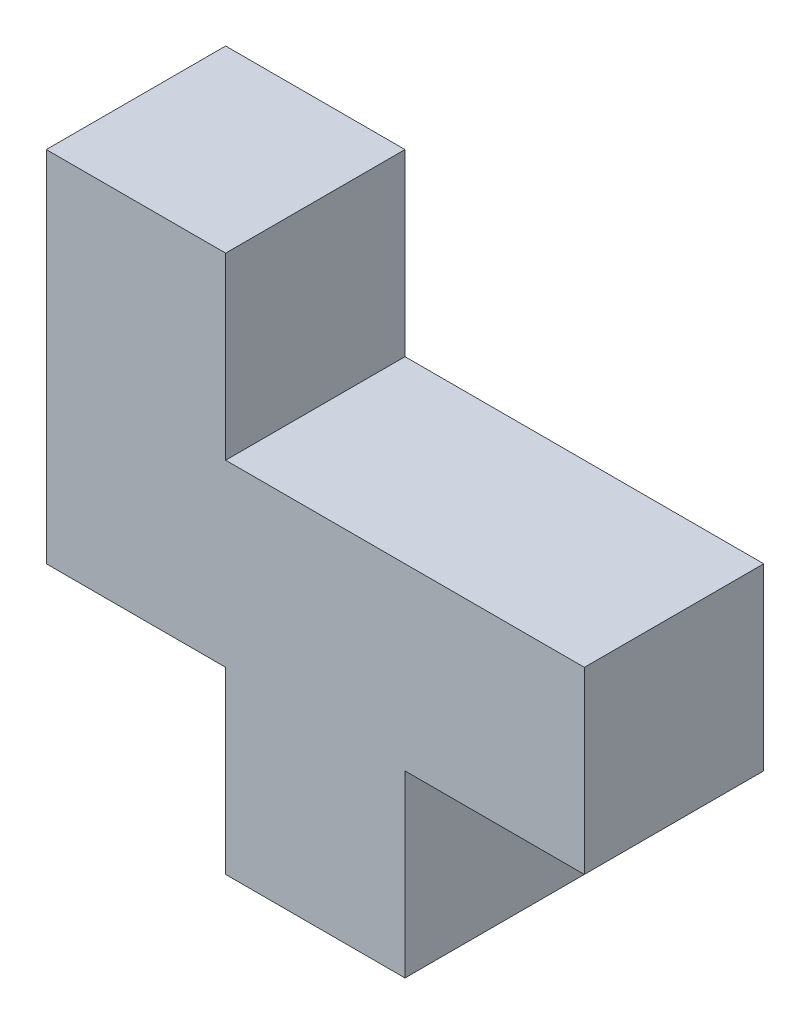
ISO-10303-21;
HEADER;
FILE_DESCRIPTION(('STEP AP214'),'2;1');
FILE_NAME('part.step','',(''),(''),'','','');
FILE_SCHEMA(('AUTOMOTIVE_DESIGN { 1 0 10303 214 1 1 1 1 }'));
ENDSEC;
DATA;
#1=APPLICATION_CONTEXT('core data for automotive mechanical design processes');
#2=APPLICATION_PROTOCOL_DEFINITION('international standard','automotive_design',2000,#1);
#3=PRODUCT_CONTEXT('',#1,'mechanical');
#4=PRODUCT('Part','Part','',(#3));
#5=PRODUCT_RELATED_PRODUCT_CATEGORY('part','',(#4));
#6=PRODUCT_DEFINITION_FORMATION('','',#4);
#7=PRODUCT_DEFINITION_CONTEXT('part definition',#1,'design');
#8=PRODUCT_DEFINITION('design','',#6,#7);
#9=PRODUCT_DEFINITION_SHAPE('','',#8);
#10=(LENGTH_UNIT() NAMED_UNIT(*) SI_UNIT(.MILLI.,.METRE.));
#11=(NAMED_UNIT(*) PLANE_ANGLE_UNIT() SI_UNIT($,.RADIAN.));
#12=(NAMED_UNIT(*) SI_UNIT($,.STERADIAN.) SOLID_ANGLE_UNIT());
#13=UNCERTAINTY_MEASURE_WITH_UNIT(LENGTH_MEASURE(1.E-05),#10,'distance_accuracy_value','');
#14=(GEOMETRIC_REPRESENTATION_CONTEXT(3) GLOBAL_UNCERTAINTY_ASSIGNED_CONTEXT((#13)) GLOBAL_UNIT_ASSIGNED_CONTEXT((#10,
#11,#12)) REPRESENTATION_CONTEXT('',''));
#15=CARTESIAN_POINT('',(0.,0.,0.));
#16=DIRECTION('',(0.,0.,1.));
#17=DIRECTION('',(1.,0.,0.));
#18=AXIS2_PLACEMENT_3D('',#15,#16,#17);
#19=CARTESIAN_POINT('',(25.4,0.,25.4));
#20=DIRECTION('',(0.,1.,0.));
#21=DIRECTION('',(0.,0.,1.));
#22=AXIS2_PLACEMENT_3D('',#19,#20,#21);
#23=PLANE('',#22);
#24=DIRECTION('',(1.,0.,0.));
#25=VECTOR('',#24,1.);
#26=CARTESIAN_POINT('',(25.4,0.,0.));
#27=LINE('',#26,#25);
#28=CARTESIAN_POINT('',(25.4,0.,0.));
#29=VERTEX_POINT('',#28);
#30=CARTESIAN_POINT('',(50.8,0.,0.));
#31=VERTEX_POINT('',#30);
#32=EDGE_CURVE('E141',#29,#31,#27,.T.);
#33=ORIENTED_EDGE('',*,*,#32,.T.);
#34=DIRECTION('',(0.,0.,-1.));
#35=VECTOR('',#34,1.);
#36=CARTESIAN_POINT('',(50.8,0.,25.4));
#37=LINE('',#36,#35);
#38=CARTESIAN_POINT('',(50.8,0.,25.4));
#39=VERTEX_POINT('',#38);
#40=EDGE_CURVE('E11',#39,#31,#37,.T.);
#41=ORIENTED_EDGE('',*,*,#40,.F.);
#42=DIRECTION('',(1.,0.,0.));
#43=VECTOR('',#42,1.);
#44=CARTESIAN_POINT('',(25.4,0.,25.4));
#45=LINE('',#44,#43);
#46=CARTESIAN_POINT('',(25.4,0.,25.4));
#47=VERTEX_POINT('',#46);
#48=EDGE_CURVE('E159',#47,#39,#45,.T.);
#49=ORIENTED_EDGE('',*,*,#48,.F.);
#50=DIRECTION('',(0.,0.,-1.));
#51=VECTOR('',#50,1.);
#52=CARTESIAN_POINT('',(25.4,0.,25.4));
#53=LINE('',#52,#51);
#54=EDGE_CURVE('E137',#47,#29,#53,.T.);
#55=ORIENTED_EDGE('',*,*,#54,.T.);
#56=EDGE_LOOP('',(#33,#41,#49,#55));
#57=FACE_BOUND('',#56,.T.);
#58=ADVANCED_FACE('F33',(#57),#23,.F.);
#59=CARTESIAN_POINT('',(50.8,0.,25.4));
#60=DIRECTION('',(-1.,0.,0.));
#61=DIRECTION('',(0.,0.,1.));
#62=AXIS2_PLACEMENT_3D('',#59,#60,#61);
#63=PLANE('',#62);
#64=DIRECTION('',(0.,1.,0.));
#65=VECTOR('',#64,1.);
#66=CARTESIAN_POINT('',(50.8,0.,0.));
#67=LINE('',#66,#65);
#68=CARTESIAN_POINT('',(50.8,25.4,0.));
#69=VERTEX_POINT('',#68);
#70=EDGE_CURVE('E144',#31,#69,#67,.T.);
#71=ORIENTED_EDGE('',*,*,#70,.T.);
#72=DIRECTION('',(0.,0.,-1.));
#73=VECTOR('',#72,1.);
#74=CARTESIAN_POINT('',(50.8,25.4,25.4));
#75=LINE('',#74,#73);
#76=CARTESIAN_POINT('',(50.8,25.4,25.4));
#77=VERTEX_POINT('',#76);
#78=EDGE_CURVE('E41',#77,#69,#75,.T.);
#79=ORIENTED_EDGE('',*,*,#78,.F.);
#80=DIRECTION('',(0.,1.,0.));
#81=VECTOR('',#80,1.);
#82=CARTESIAN_POINT('',(50.8,0.,25.4));
#83=LINE('',#82,#81);
#84=EDGE_CURVE('E98',#39,#77,#83,.T.);
#85=ORIENTED_EDGE('',*,*,#84,.F.);
#86=ORIENTED_EDGE('',*,*,#40,.T.);
#87=EDGE_LOOP('',(#71,#79,#85,#86));
#88=FACE_BOUND('',#87,.T.);
#89=ADVANCED_FACE('F208',(#88),#63,.F.);
#90=CARTESIAN_POINT('',(50.8,25.4,25.4));
#91=DIRECTION('',(0.,1.,0.));
#92=DIRECTION('',(0.,0.,1.));
#93=AXIS2_PLACEMENT_3D('',#90,#91,#92);
#94=PLANE('',#93);
#95=DIRECTION('',(1.,0.,0.));
#96=VECTOR('',#95,1.);
#97=CARTESIAN_POINT('',(50.8,25.4,0.));
#98=LINE('',#97,#96);
#99=CARTESIAN_POINT('',(76.2,25.4,0.));
#100=VERTEX_POINT('',#99);
#101=EDGE_CURVE('E146',#69,#100,#98,.T.);
#102=ORIENTED_EDGE('',*,*,#101,.T.);
#103=DIRECTION('',(0.,0.,-1.));
#104=VECTOR('',#103,1.);
#105=CARTESIAN_POINT('',(76.2,25.4,25.4));
#106=LINE('',#105,#104);
#107=CARTESIAN_POINT('',(76.2,25.4,25.4));
#108=VERTEX_POINT('',#107);
#109=EDGE_CURVE('E172',#108,#100,#106,.T.);
#110=ORIENTED_EDGE('',*,*,#109,.F.);
#111=DIRECTION('',(1.,0.,0.));
#112=VECTOR('',#111,1.);
#113=CARTESIAN_POINT('',(50.8,25.4,25.4));
#114=LINE('',#113,#112);
#115=EDGE_CURVE('E180',#77,#108,#114,.T.);
#116=ORIENTED_EDGE('',*,*,#115,.F.);
#117=ORIENTED_EDGE('',*,*,#78,.T.);
#118=EDGE_LOOP('',(#102,#110,#116,#117));
#119=FACE_BOUND('',#118,.T.);
#120=ADVANCED_FACE('F178',(#119),#94,.F.);
#121=CARTESIAN_POINT('',(76.2,25.4,25.4));
#122=DIRECTION('',(-1.,0.,0.));
#123=DIRECTION('',(0.,0.,1.));
#124=AXIS2_PLACEMENT_3D('',#121,#122,#123);
#125=PLANE('',#124);
#126=DIRECTION('',(0.,1.,0.));
#127=VECTOR('',#126,1.);
#128=CARTESIAN_POINT('',(76.2,25.4,0.));
#129=LINE('',#128,#127);
#130=CARTESIAN_POINT('',(76.2,50.8,0.));
#131=VERTEX_POINT('',#130);
#132=EDGE_CURVE('E148',#100,#131,#129,.T.);
#133=ORIENTED_EDGE('',*,*,#132,.T.);
#134=DIRECTION('',(0.,0.,-1.));
#135=VECTOR('',#134,1.);
#136=CARTESIAN_POINT('',(76.2,50.8,25.4));
#137=LINE('',#136,#135);
#138=CARTESIAN_POINT('',(76.2,50.8,25.4));
#139=VERTEX_POINT('',#138);
#140=EDGE_CURVE('E169',#139,#131,#137,.T.);
#141=ORIENTED_EDGE('',*,*,#140,.F.);
#142=DIRECTION('',(0.,1.,0.));
#143=VECTOR('',#142,1.);
#144=CARTESIAN_POINT('',(76.2,25.4,25.4));
#145=LINE('',#144,#143);
#146=EDGE_CURVE('E198',#108,#139,#145,.T.);
#147=ORIENTED_EDGE('',*,*,#146,.F.);
#148=ORIENTED_EDGE('',*,*,#109,.T.);
#149=EDGE_LOOP('',(#133,#141,#147,#148));
#150=FACE_BOUND('',#149,.T.);
#151=ADVANCED_FACE('F189',(#150),#125,.F.);
#152=CARTESIAN_POINT('',(76.2,50.8,25.4));
#153=DIRECTION('',(0.,-1.,0.));
#154=DIRECTION('',(0.,0.,-1.));
#155=AXIS2_PLACEMENT_3D('',#152,#153,#154);
#156=PLANE('',#155);
#157=DIRECTION('',(-1.,0.,0.));
#158=VECTOR('',#157,1.);
#159=CARTESIAN_POINT('',(76.2,50.8,0.));
#160=LINE('',#159,#158);
#161=CARTESIAN_POINT('',(25.4,50.8,0.));
#162=VERTEX_POINT('',#161);
#163=EDGE_CURVE('E150',#131,#162,#160,.T.);
#164=ORIENTED_EDGE('',*,*,#163,.T.);
#165=DIRECTION('',(0.,0.,-1.));
#166=VECTOR('',#165,1.);
#167=CARTESIAN_POINT('',(25.4,50.8,25.4));
#168=LINE('',#167,#166);
#169=CARTESIAN_POINT('',(25.4,50.8,25.4));
#170=VERTEX_POINT('',#169);
#171=EDGE_CURVE('E166',#170,#162,#168,.T.);
#172=ORIENTED_EDGE('',*,*,#171,.F.);
#173=DIRECTION('',(-1.,0.,0.));
#174=VECTOR('',#173,1.);
#175=CARTESIAN_POINT('',(76.2,50.8,25.4));
#176=LINE('',#175,#174);
#177=EDGE_CURVE('E195',#139,#170,#176,.T.);
#178=ORIENTED_EDGE('',*,*,#177,.F.);
#179=ORIENTED_EDGE('',*,*,#140,.T.);
#180=EDGE_LOOP('',(#164,#172,#178,#179));
#181=FACE_BOUND('',#180,.T.);
#182=ADVANCED_FACE('F193',(#181),#156,.F.);
#183=CARTESIAN_POINT('',(25.4,50.8,25.4));
#184=DIRECTION('',(-1.,0.,0.));
#185=DIRECTION('',(0.,0.,1.));
#186=AXIS2_PLACEMENT_3D('',#183,#184,#185);
#187=PLANE('',#186);
#188=DIRECTION('',(0.,1.,0.));
#189=VECTOR('',#188,1.);
#190=CARTESIAN_POINT('',(25.4,50.8,0.));
#191=LINE('',#190,#189);
#192=CARTESIAN_POINT('',(25.4,76.2,0.));
#193=VERTEX_POINT('',#192);
#194=EDGE_CURVE('E152',#162,#193,#191,.T.);
#195=ORIENTED_EDGE('',*,*,#194,.T.);
#196=DIRECTION('',(0.,0.,-1.));
#197=VECTOR('',#196,1.);
#198=CARTESIAN_POINT('',(25.4,76.2,25.4));
#199=LINE('',#198,#197);
#200=CARTESIAN_POINT('',(25.4,76.2,25.4));
#201=VERTEX_POINT('',#200);
#202=EDGE_CURVE('E163',#201,#193,#199,.T.);
#203=ORIENTED_EDGE('',*,*,#202,.F.);
#204=DIRECTION('',(0.,1.,0.));
#205=VECTOR('',#204,1.);
#206=CARTESIAN_POINT('',(25.4,50.8,25.4));
#207=LINE('',#206,#205);
#208=EDGE_CURVE('E197',#170,#201,#207,.T.);
#209=ORIENTED_EDGE('',*,*,#208,.F.);
#210=ORIENTED_EDGE('',*,*,#171,.T.);
#211=EDGE_LOOP('',(#195,#203,#209,#210));
#212=FACE_BOUND('',#211,.T.);
#213=ADVANCED_FACE('F220',(#212),#187,.F.);
#214=CARTESIAN_POINT('',(25.4,76.2,25.4));
#215=DIRECTION('',(0.,-1.,0.));
#216=DIRECTION('',(0.,0.,-1.));
#217=AXIS2_PLACEMENT_3D('',#214,#215,#216);
#218=PLANE('',#217);
#219=DIRECTION('',(-1.,0.,0.));
#220=VECTOR('',#219,1.);
#221=CARTESIAN_POINT('',(25.4,76.2,0.));
#222=LINE('',#221,#220);
#223=CARTESIAN_POINT('',(0.,76.2,0.));
#224=VERTEX_POINT('',#223);
#225=EDGE_CURVE('E154',#193,#224,#222,.T.);
#226=ORIENTED_EDGE('',*,*,#225,.T.);
#227=DIRECTION('',(0.,0.,-1.));
#228=VECTOR('',#227,1.);
#229=CARTESIAN_POINT('',(0.,76.2,25.4));
#230=LINE('',#229,#228);
#231=CARTESIAN_POINT('',(0.,76.2,25.4));
#232=VERTEX_POINT('',#231);
#233=EDGE_CURVE('E132',#232,#224,#230,.T.);
#234=ORIENTED_EDGE('',*,*,#233,.F.);
#235=DIRECTION('',(-1.,0.,0.));
#236=VECTOR('',#235,1.);
#237=CARTESIAN_POINT('',(25.4,76.2,25.4));
#238=LINE('',#237,#236);
#239=EDGE_CURVE('E123',#201,#232,#238,.T.);
#240=ORIENTED_EDGE('',*,*,#239,.F.);
#241=ORIENTED_EDGE('',*,*,#202,.T.);
#242=EDGE_LOOP('',(#226,#234,#240,#241));
#243=FACE_BOUND('',#242,.T.);
#244=ADVANCED_FACE('F223',(#243),#218,.F.);
#245=CARTESIAN_POINT('',(0.,76.2,25.4));
#246=DIRECTION('',(1.,0.,0.));
#247=DIRECTION('',(0.,0.,-1.));
#248=AXIS2_PLACEMENT_3D('',#245,#246,#247);
#249=PLANE('',#248);
#250=DIRECTION('',(0.,-1.,0.));
#251=VECTOR('',#250,1.);
#252=CARTESIAN_POINT('',(0.,76.2,0.));
#253=LINE('',#252,#251);
#254=CARTESIAN_POINT('',(0.,25.4,0.));
#255=VERTEX_POINT('',#254);
#256=EDGE_CURVE('E131',#224,#255,#253,.T.);
#257=ORIENTED_EDGE('',*,*,#256,.T.);
#258=DIRECTION('',(0.,0.,-1.));
#259=VECTOR('',#258,1.);
#260=CARTESIAN_POINT('',(0.,25.4,25.4));
#261=LINE('',#260,#259);
#262=CARTESIAN_POINT('',(0.,25.4,25.4));
#263=VERTEX_POINT('',#262);
#264=EDGE_CURVE('E128',#263,#255,#261,.T.);
#265=ORIENTED_EDGE('',*,*,#264,.F.);
#266=DIRECTION('',(0.,-1.,0.));
#267=VECTOR('',#266,1.);
#268=CARTESIAN_POINT('',(0.,76.2,25.4));
#269=LINE('',#268,#267);
#270=EDGE_CURVE('E117',#232,#263,#269,.T.);
#271=ORIENTED_EDGE('',*,*,#270,.F.);
#272=ORIENTED_EDGE('',*,*,#233,.T.);
#273=EDGE_LOOP('',(#257,#265,#271,#272));
#274=FACE_BOUND('',#273,.T.);
#275=ADVANCED_FACE('F129',(#274),#249,.F.);
#276=CARTESIAN_POINT('',(0.,25.4,25.4));
#277=DIRECTION('',(0.,1.,0.));
#278=DIRECTION('',(0.,0.,1.));
#279=AXIS2_PLACEMENT_3D('',#276,#277,#278);
#280=PLANE('',#279);
#281=DIRECTION('',(1.,0.,0.));
#282=VECTOR('',#281,1.);
#283=CARTESIAN_POINT('',(0.,25.4,0.));
#284=LINE('',#283,#282);
#285=CARTESIAN_POINT('',(25.4,25.4,0.));
#286=VERTEX_POINT('',#285);
#287=EDGE_CURVE('E84',#255,#286,#284,.T.);
#288=ORIENTED_EDGE('',*,*,#287,.T.);
#289=DIRECTION('',(0.,0.,-1.));
#290=VECTOR('',#289,1.);
#291=CARTESIAN_POINT('',(25.4,25.4,25.4));
#292=LINE('',#291,#290);
#293=CARTESIAN_POINT('',(25.4,25.4,25.4));
#294=VERTEX_POINT('',#293);
#295=EDGE_CURVE('E133',#294,#286,#292,.T.);
#296=ORIENTED_EDGE('',*,*,#295,.F.);
#297=DIRECTION('',(1.,0.,0.));
#298=VECTOR('',#297,1.);
#299=CARTESIAN_POINT('',(0.,25.4,25.4));
#300=LINE('',#299,#298);
#301=EDGE_CURVE('E121',#263,#294,#300,.T.);
#302=ORIENTED_EDGE('',*,*,#301,.F.);
#303=ORIENTED_EDGE('',*,*,#264,.T.);
#304=EDGE_LOOP('',(#288,#296,#302,#303));
#305=FACE_BOUND('',#304,.T.);
#306=ADVANCED_FACE('F135',(#305),#280,.F.);
#307=CARTESIAN_POINT('',(25.4,25.4,25.4));
#308=DIRECTION('',(1.,0.,0.));
#309=DIRECTION('',(0.,0.,-1.));
#310=AXIS2_PLACEMENT_3D('',#307,#308,#309);
#311=PLANE('',#310);
#312=DIRECTION('',(0.,-1.,0.));
#313=VECTOR('',#312,1.);
#314=CARTESIAN_POINT('',(25.4,25.4,0.));
#315=LINE('',#314,#313);
#316=EDGE_CURVE('E90',#286,#29,#315,.T.);
#317=ORIENTED_EDGE('',*,*,#316,.T.);
#318=ORIENTED_EDGE('',*,*,#54,.F.);
#319=DIRECTION('',(0.,-1.,0.));
#320=VECTOR('',#319,1.);
#321=CARTESIAN_POINT('',(25.4,25.4,25.4));
#322=LINE('',#321,#320);
#323=EDGE_CURVE('E49',#294,#47,#322,.T.);
#324=ORIENTED_EDGE('',*,*,#323,.F.);
#325=ORIENTED_EDGE('',*,*,#295,.T.);
#326=EDGE_LOOP('',(#317,#318,#324,#325));
#327=FACE_BOUND('',#326,.T.);
#328=ADVANCED_FACE('F232',(#327),#311,.F.);
#329=CARTESIAN_POINT('',(0.,0.,25.4));
#330=DIRECTION('',(0.,0.,1.));
#331=DIRECTION('',(1.,0.,0.));
#332=AXIS2_PLACEMENT_3D('',#329,#330,#331);
#333=PLANE('',#332);
#334=ORIENTED_EDGE('',*,*,#48,.T.);
#335=ORIENTED_EDGE('',*,*,#84,.T.);
#336=ORIENTED_EDGE('',*,*,#115,.T.);
#337=ORIENTED_EDGE('',*,*,#146,.T.);
#338=ORIENTED_EDGE('',*,*,#177,.T.);
#339=ORIENTED_EDGE('',*,*,#208,.T.);
#340=ORIENTED_EDGE('',*,*,#239,.T.);
#341=ORIENTED_EDGE('',*,*,#270,.T.);
#342=ORIENTED_EDGE('',*,*,#301,.T.);
#343=ORIENTED_EDGE('',*,*,#323,.T.);
#344=EDGE_LOOP('',(#334,#335,#336,#337,#338,#339,#340,#341,#342,#343));
#345=FACE_BOUND('',#344,.T.);
#346=ADVANCED_FACE('F119',(#345),#333,.T.);
#347=CARTESIAN_POINT('',(0.,0.,0.));
#348=DIRECTION('',(0.,0.,1.));
#349=DIRECTION('',(1.,0.,0.));
#350=AXIS2_PLACEMENT_3D('',#347,#348,#349);
#351=PLANE('',#350);
#352=ORIENTED_EDGE('',*,*,#32,.F.);
#353=ORIENTED_EDGE('',*,*,#316,.F.);
#354=ORIENTED_EDGE('',*,*,#287,.F.);
#355=ORIENTED_EDGE('',*,*,#256,.F.);
#356=ORIENTED_EDGE('',*,*,#225,.F.);
#357=ORIENTED_EDGE('',*,*,#194,.F.);
#358=ORIENTED_EDGE('',*,*,#163,.F.);
#359=ORIENTED_EDGE('',*,*,#132,.F.);
#360=ORIENTED_EDGE('',*,*,#101,.F.);
#361=ORIENTED_EDGE('',*,*,#70,.F.);
#362=EDGE_LOOP('',(#352,#353,#354,#355,#356,#357,#358,#359,#360,#361));
#363=FACE_BOUND('',#362,.T.);
#364=ADVANCED_FACE('F184',(#363),#351,.F.);
#365=CLOSED_SHELL('',(#58,#89,#120,#151,#182,#213,#244,#275,#306,#328,#346,#364));
#366=MANIFOLD_SOLID_BREP('B2',#365);
#367=ADVANCED_BREP_SHAPE_REPRESENTATION('',(#18,#366),#14);
#368=SHAPE_DEFINITION_REPRESENTATION(#9,#367);
ENDSEC;
END-ISO-10303-21;
